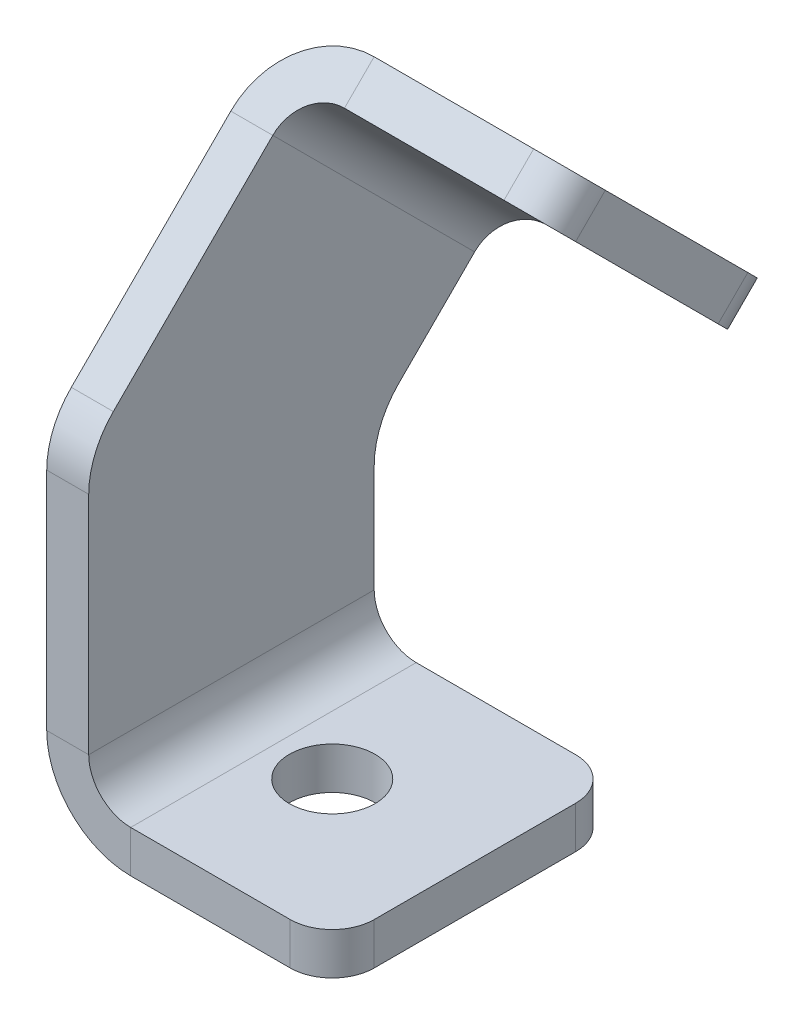
ISO-10303-21;
HEADER;
FILE_DESCRIPTION(('STEP AP214'),'2;1');
FILE_NAME('part.step','',(''),(''),'','','');
FILE_SCHEMA(('AUTOMOTIVE_DESIGN { 1 0 10303 214 1 1 1 1 }'));
ENDSEC;
DATA;
#1=APPLICATION_CONTEXT('core data for automotive mechanical design processes');
#2=APPLICATION_PROTOCOL_DEFINITION('international standard','automotive_design',2000,#1);
#3=PRODUCT_CONTEXT('',#1,'mechanical');
#4=PRODUCT('Part','Part','',(#3));
#5=PRODUCT_RELATED_PRODUCT_CATEGORY('part','',(#4));
#6=PRODUCT_DEFINITION_FORMATION('','',#4);
#7=PRODUCT_DEFINITION_CONTEXT('part definition',#1,'design');
#8=PRODUCT_DEFINITION('design','',#6,#7);
#9=PRODUCT_DEFINITION_SHAPE('','',#8);
#10=(LENGTH_UNIT() NAMED_UNIT(*) SI_UNIT(.MILLI.,.METRE.));
#11=(NAMED_UNIT(*) PLANE_ANGLE_UNIT() SI_UNIT($,.RADIAN.));
#12=(NAMED_UNIT(*) SI_UNIT($,.STERADIAN.) SOLID_ANGLE_UNIT());
#13=UNCERTAINTY_MEASURE_WITH_UNIT(LENGTH_MEASURE(1.E-05),#10,'distance_accuracy_value','');
#14=(GEOMETRIC_REPRESENTATION_CONTEXT(3) GLOBAL_UNCERTAINTY_ASSIGNED_CONTEXT((#13)) GLOBAL_UNIT_ASSIGNED_CONTEXT((#10,
#11,#12)) REPRESENTATION_CONTEXT('',''));
#15=CARTESIAN_POINT('',(0.,0.,0.));
#16=DIRECTION('',(0.,0.,1.));
#17=DIRECTION('',(1.,0.,0.));
#18=AXIS2_PLACEMENT_3D('',#15,#16,#17);
#19=CARTESIAN_POINT('',(2.5,18.4289321881345,12.));
#20=DIRECTION('',(1.,0.,0.));
#21=DIRECTION('',(0.,0.,-1.));
#22=AXIS2_PLACEMENT_3D('',#19,#20,#21);
#23=CYLINDRICAL_SURFACE('',#22,5.);
#24=DIRECTION('',(1.,0.,0.));
#25=VECTOR('',#24,1.);
#26=CARTESIAN_POINT('',(2.5,21.9644660940673,15.5355339059327));
#27=LINE('',#26,#25);
#28=CARTESIAN_POINT('',(0.,21.9644660940673,15.5355339059327));
#29=VERTEX_POINT('',#28);
#30=CARTESIAN_POINT('',(2.5,21.9644660940673,15.5355339059327));
#31=VERTEX_POINT('',#30);
#32=EDGE_CURVE('E10',#29,#31,#27,.T.);
#33=ORIENTED_EDGE('',*,*,#32,.F.);
#34=CARTESIAN_POINT('',(0.,18.4289321881345,12.));
#35=DIRECTION('',(1.,0.,0.));
#36=DIRECTION('',(0.,0.,-1.));
#37=AXIS2_PLACEMENT_3D('',#34,#35,#36);
#38=CIRCLE('',#37,5.);
#39=CARTESIAN_POINT('',(0.,18.4289321881345,17.));
#40=VERTEX_POINT('',#39);
#41=EDGE_CURVE('E136',#29,#40,#38,.T.);
#42=ORIENTED_EDGE('',*,*,#41,.T.);
#43=DIRECTION('',(1.,0.,0.));
#44=VECTOR('',#43,1.);
#45=CARTESIAN_POINT('',(2.5,18.4289321881345,17.));
#46=LINE('',#45,#44);
#47=CARTESIAN_POINT('',(2.5,18.4289321881345,17.));
#48=VERTEX_POINT('',#47);
#49=EDGE_CURVE('E26',#40,#48,#46,.T.);
#50=ORIENTED_EDGE('',*,*,#49,.T.);
#51=CARTESIAN_POINT('',(2.5,18.4289321881345,12.));
#52=DIRECTION('',(1.,0.,0.));
#53=DIRECTION('',(0.,0.,-1.));
#54=AXIS2_PLACEMENT_3D('',#51,#52,#53);
#55=CIRCLE('',#54,5.);
#56=EDGE_CURVE('E254',#31,#48,#55,.T.);
#57=ORIENTED_EDGE('',*,*,#56,.F.);
#58=EDGE_LOOP('',(#33,#42,#50,#57));
#59=FACE_BOUND('',#58,.T.);
#60=ADVANCED_FACE('F16',(#59),#23,.T.);
#61=CARTESIAN_POINT('',(2.5,0.,17.));
#62=DIRECTION('',(0.,0.,-1.));
#63=DIRECTION('',(0.,1.,0.));
#64=AXIS2_PLACEMENT_3D('',#61,#62,#63);
#65=PLANE('',#64);
#66=ORIENTED_EDGE('',*,*,#49,.F.);
#67=DIRECTION('',(0.,1.,0.));
#68=VECTOR('',#67,1.);
#69=CARTESIAN_POINT('',(0.,0.,17.));
#70=LINE('',#69,#68);
#71=CARTESIAN_POINT('',(0.,5.,17.));
#72=VERTEX_POINT('',#71);
#73=EDGE_CURVE('E195',#40,#72,#70,.F.);
#74=ORIENTED_EDGE('',*,*,#73,.T.);
#75=DIRECTION('',(1.,0.,0.));
#76=VECTOR('',#75,1.);
#77=CARTESIAN_POINT('',(2.5,5.,17.));
#78=LINE('',#77,#76);
#79=CARTESIAN_POINT('',(2.5,5.,17.));
#80=VERTEX_POINT('',#79);
#81=EDGE_CURVE('E247',#72,#80,#78,.T.);
#82=ORIENTED_EDGE('',*,*,#81,.T.);
#83=DIRECTION('',(0.,1.,0.));
#84=VECTOR('',#83,1.);
#85=CARTESIAN_POINT('',(2.5,0.,17.));
#86=LINE('',#85,#84);
#87=EDGE_CURVE('E264',#48,#80,#86,.F.);
#88=ORIENTED_EDGE('',*,*,#87,.F.);
#89=EDGE_LOOP('',(#66,#74,#82,#88));
#90=FACE_BOUND('',#89,.T.);
#91=ADVANCED_FACE('F267',(#90),#65,.F.);
#92=CARTESIAN_POINT('',(5.,5.,17.));
#93=DIRECTION('',(0.,0.,1.));
#94=DIRECTION('',(1.,0.,0.));
#95=AXIS2_PLACEMENT_3D('',#92,#93,#94);
#96=PLANE('',#95);
#97=ORIENTED_EDGE('',*,*,#81,.F.);
#98=CARTESIAN_POINT('',(5.,5.,17.));
#99=DIRECTION('',(0.,0.,1.));
#100=DIRECTION('',(1.,0.,0.));
#101=AXIS2_PLACEMENT_3D('',#98,#99,#100);
#102=CIRCLE('',#101,5.);
#103=CARTESIAN_POINT('',(5.,0.,17.));
#104=VERTEX_POINT('',#103);
#105=EDGE_CURVE('E170',#104,#72,#102,.F.);
#106=ORIENTED_EDGE('',*,*,#105,.F.);
#107=DIRECTION('',(0.,1.,0.));
#108=VECTOR('',#107,1.);
#109=CARTESIAN_POINT('',(5.,2.5,17.));
#110=LINE('',#109,#108);
#111=CARTESIAN_POINT('',(5.,2.5,17.));
#112=VERTEX_POINT('',#111);
#113=EDGE_CURVE('E244',#104,#112,#110,.T.);
#114=ORIENTED_EDGE('',*,*,#113,.T.);
#115=CARTESIAN_POINT('',(5.,5.,17.));
#116=DIRECTION('',(0.,0.,-1.));
#117=DIRECTION('',(-1.,0.,0.));
#118=AXIS2_PLACEMENT_3D('',#115,#116,#117);
#119=CIRCLE('',#118,2.5);
#120=EDGE_CURVE('E279',#112,#80,#119,.T.);
#121=ORIENTED_EDGE('',*,*,#120,.T.);
#122=EDGE_LOOP('',(#97,#106,#114,#121));
#123=FACE_BOUND('',#122,.T.);
#124=ADVANCED_FACE('F336',(#123),#96,.T.);
#125=CARTESIAN_POINT('',(0.,2.5,17.));
#126=DIRECTION('',(0.,0.,1.));
#127=DIRECTION('',(1.,0.,0.));
#128=AXIS2_PLACEMENT_3D('',#125,#126,#127);
#129=PLANE('',#128);
#130=ORIENTED_EDGE('',*,*,#113,.F.);
#131=DIRECTION('',(1.,0.,0.));
#132=VECTOR('',#131,1.);
#133=CARTESIAN_POINT('',(0.,0.,17.));
#134=LINE('',#133,#132);
#135=CARTESIAN_POINT('',(14.5,0.,17.));
#136=VERTEX_POINT('',#135);
#137=EDGE_CURVE('E190',#104,#136,#134,.T.);
#138=ORIENTED_EDGE('',*,*,#137,.T.);
#139=DIRECTION('',(0.,1.,0.));
#140=VECTOR('',#139,1.);
#141=CARTESIAN_POINT('',(14.5,2.5,17.));
#142=LINE('',#141,#140);
#143=CARTESIAN_POINT('',(14.5,2.5,17.));
#144=VERTEX_POINT('',#143);
#145=EDGE_CURVE('E241',#136,#144,#142,.T.);
#146=ORIENTED_EDGE('',*,*,#145,.T.);
#147=DIRECTION('',(1.,0.,0.));
#148=VECTOR('',#147,1.);
#149=CARTESIAN_POINT('',(0.,2.5,17.));
#150=LINE('',#149,#148);
#151=EDGE_CURVE('E388',#112,#144,#150,.T.);
#152=ORIENTED_EDGE('',*,*,#151,.F.);
#153=EDGE_LOOP('',(#130,#138,#146,#152));
#154=FACE_BOUND('',#153,.T.);
#155=ADVANCED_FACE('F658',(#154),#129,.T.);
#156=CARTESIAN_POINT('',(14.5,2.5,14.5));
#157=DIRECTION('',(0.,1.,0.));
#158=DIRECTION('',(0.,0.,1.));
#159=AXIS2_PLACEMENT_3D('',#156,#157,#158);
#160=CYLINDRICAL_SURFACE('',#159,2.5);
#161=ORIENTED_EDGE('',*,*,#145,.F.);
#162=CARTESIAN_POINT('',(14.5,0.,14.5));
#163=DIRECTION('',(0.,1.,0.));
#164=DIRECTION('',(0.,0.,1.));
#165=AXIS2_PLACEMENT_3D('',#162,#163,#164);
#166=CIRCLE('',#165,2.5);
#167=CARTESIAN_POINT('',(17.,0.,14.5));
#168=VERTEX_POINT('',#167);
#169=EDGE_CURVE('E166',#136,#168,#166,.T.);
#170=ORIENTED_EDGE('',*,*,#169,.T.);
#171=DIRECTION('',(0.,1.,0.));
#172=VECTOR('',#171,1.);
#173=CARTESIAN_POINT('',(17.,2.5,14.5));
#174=LINE('',#173,#172);
#175=CARTESIAN_POINT('',(17.,2.5,14.5));
#176=VERTEX_POINT('',#175);
#177=EDGE_CURVE('E238',#168,#176,#174,.T.);
#178=ORIENTED_EDGE('',*,*,#177,.T.);
#179=CARTESIAN_POINT('',(14.5,2.5,14.5));
#180=DIRECTION('',(0.,1.,0.));
#181=DIRECTION('',(0.,0.,1.));
#182=AXIS2_PLACEMENT_3D('',#179,#180,#181);
#183=CIRCLE('',#182,2.5);
#184=EDGE_CURVE('E384',#144,#176,#183,.T.);
#185=ORIENTED_EDGE('',*,*,#184,.F.);
#186=EDGE_LOOP('',(#161,#170,#178,#185));
#187=FACE_BOUND('',#186,.T.);
#188=ADVANCED_FACE('F649',(#187),#160,.T.);
#189=CARTESIAN_POINT('',(17.,2.5,17.));
#190=DIRECTION('',(1.,0.,0.));
#191=DIRECTION('',(0.,0.,-1.));
#192=AXIS2_PLACEMENT_3D('',#189,#190,#191);
#193=PLANE('',#192);
#194=ORIENTED_EDGE('',*,*,#177,.F.);
#195=DIRECTION('',(0.,0.,1.));
#196=VECTOR('',#195,1.);
#197=CARTESIAN_POINT('',(17.,0.,17.));
#198=LINE('',#197,#196);
#199=CARTESIAN_POINT('',(17.,0.,2.5));
#200=VERTEX_POINT('',#199);
#201=EDGE_CURVE('E184',#168,#200,#198,.F.);
#202=ORIENTED_EDGE('',*,*,#201,.T.);
#203=DIRECTION('',(0.,1.,0.));
#204=VECTOR('',#203,1.);
#205=CARTESIAN_POINT('',(17.,2.5,2.5));
#206=LINE('',#205,#204);
#207=CARTESIAN_POINT('',(17.,2.5,2.5));
#208=VERTEX_POINT('',#207);
#209=EDGE_CURVE('E235',#200,#208,#206,.T.);
#210=ORIENTED_EDGE('',*,*,#209,.T.);
#211=DIRECTION('',(0.,0.,-1.));
#212=VECTOR('',#211,1.);
#213=CARTESIAN_POINT('',(17.,2.5,17.));
#214=LINE('',#213,#212);
#215=EDGE_CURVE('E401',#176,#208,#214,.T.);
#216=ORIENTED_EDGE('',*,*,#215,.F.);
#217=EDGE_LOOP('',(#194,#202,#210,#216));
#218=FACE_BOUND('',#217,.T.);
#219=ADVANCED_FACE('F640',(#218),#193,.T.);
#220=CARTESIAN_POINT('',(14.5,2.5,2.5));
#221=DIRECTION('',(0.,1.,0.));
#222=DIRECTION('',(0.,0.,1.));
#223=AXIS2_PLACEMENT_3D('',#220,#221,#222);
#224=CYLINDRICAL_SURFACE('',#223,2.5);
#225=ORIENTED_EDGE('',*,*,#209,.F.);
#226=CARTESIAN_POINT('',(14.5,0.,2.5));
#227=DIRECTION('',(0.,1.,0.));
#228=DIRECTION('',(0.,0.,1.));
#229=AXIS2_PLACEMENT_3D('',#226,#227,#228);
#230=CIRCLE('',#229,2.5);
#231=CARTESIAN_POINT('',(14.5,0.,0.));
#232=VERTEX_POINT('',#231);
#233=EDGE_CURVE('E181',#200,#232,#230,.T.);
#234=ORIENTED_EDGE('',*,*,#233,.T.);
#235=DIRECTION('',(0.,1.,0.));
#236=VECTOR('',#235,1.);
#237=CARTESIAN_POINT('',(14.5,2.5,0.));
#238=LINE('',#237,#236);
#239=CARTESIAN_POINT('',(14.5,2.5,0.));
#240=VERTEX_POINT('',#239);
#241=EDGE_CURVE('E232',#232,#240,#238,.T.);
#242=ORIENTED_EDGE('',*,*,#241,.T.);
#243=CARTESIAN_POINT('',(14.5,2.5,2.5));
#244=DIRECTION('',(0.,1.,0.));
#245=DIRECTION('',(0.,0.,1.));
#246=AXIS2_PLACEMENT_3D('',#243,#244,#245);
#247=CIRCLE('',#246,2.5);
#248=EDGE_CURVE('E398',#208,#240,#247,.T.);
#249=ORIENTED_EDGE('',*,*,#248,.F.);
#250=EDGE_LOOP('',(#225,#234,#242,#249));
#251=FACE_BOUND('',#250,.T.);
#252=ADVANCED_FACE('F632',(#251),#224,.T.);
#253=CARTESIAN_POINT('',(0.,2.5,0.));
#254=DIRECTION('',(0.,0.,1.));
#255=DIRECTION('',(1.,0.,0.));
#256=AXIS2_PLACEMENT_3D('',#253,#254,#255);
#257=PLANE('',#256);
#258=ORIENTED_EDGE('',*,*,#241,.F.);
#259=DIRECTION('',(1.,0.,0.));
#260=VECTOR('',#259,1.);
#261=CARTESIAN_POINT('',(0.,0.,0.));
#262=LINE('',#261,#260);
#263=CARTESIAN_POINT('',(5.,0.,0.));
#264=VERTEX_POINT('',#263);
#265=EDGE_CURVE('E178',#264,#232,#262,.T.);
#266=ORIENTED_EDGE('',*,*,#265,.F.);
#267=DIRECTION('',(0.,1.,0.));
#268=VECTOR('',#267,1.);
#269=CARTESIAN_POINT('',(5.,2.5,0.));
#270=LINE('',#269,#268);
#271=CARTESIAN_POINT('',(5.,2.5,0.));
#272=VERTEX_POINT('',#271);
#273=EDGE_CURVE('E229',#264,#272,#270,.T.);
#274=ORIENTED_EDGE('',*,*,#273,.T.);
#275=DIRECTION('',(1.,0.,0.));
#276=VECTOR('',#275,1.);
#277=CARTESIAN_POINT('',(0.,2.5,0.));
#278=LINE('',#277,#276);
#279=EDGE_CURVE('E396',#272,#240,#278,.T.);
#280=ORIENTED_EDGE('',*,*,#279,.T.);
#281=EDGE_LOOP('',(#258,#266,#274,#280));
#282=FACE_BOUND('',#281,.T.);
#283=ADVANCED_FACE('F624',(#282),#257,.F.);
#284=CARTESIAN_POINT('',(5.,5.,0.));
#285=DIRECTION('',(0.,0.,1.));
#286=DIRECTION('',(1.,0.,0.));
#287=AXIS2_PLACEMENT_3D('',#284,#285,#286);
#288=PLANE('',#287);
#289=ORIENTED_EDGE('',*,*,#273,.F.);
#290=CARTESIAN_POINT('',(5.,5.,0.));
#291=DIRECTION('',(0.,0.,1.));
#292=DIRECTION('',(1.,0.,0.));
#293=AXIS2_PLACEMENT_3D('',#290,#291,#292);
#294=CIRCLE('',#293,5.);
#295=CARTESIAN_POINT('',(0.,5.,0.));
#296=VERTEX_POINT('',#295);
#297=EDGE_CURVE('E175',#296,#264,#294,.T.);
#298=ORIENTED_EDGE('',*,*,#297,.F.);
#299=DIRECTION('',(1.,0.,0.));
#300=VECTOR('',#299,1.);
#301=CARTESIAN_POINT('',(2.5,5.,0.));
#302=LINE('',#301,#300);
#303=CARTESIAN_POINT('',(2.5,5.,0.));
#304=VERTEX_POINT('',#303);
#305=EDGE_CURVE('E226',#296,#304,#302,.T.);
#306=ORIENTED_EDGE('',*,*,#305,.T.);
#307=CARTESIAN_POINT('',(5.,5.,0.));
#308=DIRECTION('',(0.,0.,-1.));
#309=DIRECTION('',(-1.,0.,0.));
#310=AXIS2_PLACEMENT_3D('',#307,#308,#309);
#311=CIRCLE('',#310,2.5);
#312=EDGE_CURVE('E281',#304,#272,#311,.F.);
#313=ORIENTED_EDGE('',*,*,#312,.T.);
#314=EDGE_LOOP('',(#289,#298,#306,#313));
#315=FACE_BOUND('',#314,.T.);
#316=ADVANCED_FACE('F319',(#315),#288,.F.);
#317=CARTESIAN_POINT('',(2.5,0.,0.));
#318=DIRECTION('',(0.,0.,-1.));
#319=DIRECTION('',(0.,1.,0.));
#320=AXIS2_PLACEMENT_3D('',#317,#318,#319);
#321=PLANE('',#320);
#322=ORIENTED_EDGE('',*,*,#305,.F.);
#323=DIRECTION('',(0.,1.,0.));
#324=VECTOR('',#323,1.);
#325=CARTESIAN_POINT('',(0.,0.,0.));
#326=LINE('',#325,#324);
#327=CARTESIAN_POINT('',(0.,11.3873016277919,0.));
#328=VERTEX_POINT('',#327);
#329=EDGE_CURVE('E171',#328,#296,#326,.F.);
#330=ORIENTED_EDGE('',*,*,#329,.F.);
#331=DIRECTION('',(1.,0.,0.));
#332=VECTOR('',#331,1.);
#333=CARTESIAN_POINT('',(2.5,11.3873016277919,0.));
#334=LINE('',#333,#332);
#335=CARTESIAN_POINT('',(2.5,11.3873016277919,0.));
#336=VERTEX_POINT('',#335);
#337=EDGE_CURVE('E223',#328,#336,#334,.T.);
#338=ORIENTED_EDGE('',*,*,#337,.T.);
#339=DIRECTION('',(0.,1.,0.));
#340=VECTOR('',#339,1.);
#341=CARTESIAN_POINT('',(2.5,0.,0.));
#342=LINE('',#341,#340);
#343=EDGE_CURVE('E270',#336,#304,#342,.F.);
#344=ORIENTED_EDGE('',*,*,#343,.T.);
#345=EDGE_LOOP('',(#322,#330,#338,#344));
#346=FACE_BOUND('',#345,.T.);
#347=ADVANCED_FACE('F608',(#346),#321,.T.);
#348=CARTESIAN_POINT('',(2.5,11.3873016277919,-5.));
#349=DIRECTION('',(1.,0.,0.));
#350=DIRECTION('',(0.,0.,-1.));
#351=AXIS2_PLACEMENT_3D('',#348,#349,#350);
#352=CYLINDRICAL_SURFACE('',#351,5.);
#353=ORIENTED_EDGE('',*,*,#337,.F.);
#354=CARTESIAN_POINT('',(0.,11.3873016277919,-5.));
#355=DIRECTION('',(1.,0.,0.));
#356=DIRECTION('',(0.,0.,-1.));
#357=AXIS2_PLACEMENT_3D('',#354,#355,#356);
#358=CIRCLE('',#357,5.);
#359=CARTESIAN_POINT('',(0.,14.9228355337246,-1.46446609406727));
#360=VERTEX_POINT('',#359);
#361=EDGE_CURVE('E167',#328,#360,#358,.F.);
#362=ORIENTED_EDGE('',*,*,#361,.T.);
#363=DIRECTION('',(1.,0.,0.));
#364=VECTOR('',#363,1.);
#365=CARTESIAN_POINT('',(2.5,14.9228355337246,-1.46446609406727));
#366=LINE('',#365,#364);
#367=CARTESIAN_POINT('',(2.5,14.9228355337246,-1.46446609406727));
#368=VERTEX_POINT('',#367);
#369=EDGE_CURVE('E220',#360,#368,#366,.T.);
#370=ORIENTED_EDGE('',*,*,#369,.T.);
#371=CARTESIAN_POINT('',(2.5,11.3873016277919,-5.));
#372=DIRECTION('',(1.,0.,0.));
#373=DIRECTION('',(0.,0.,-1.));
#374=AXIS2_PLACEMENT_3D('',#371,#372,#373);
#375=CIRCLE('',#374,5.);
#376=EDGE_CURVE('E276',#336,#368,#375,.F.);
#377=ORIENTED_EDGE('',*,*,#376,.F.);
#378=EDGE_LOOP('',(#353,#362,#370,#377));
#379=FACE_BOUND('',#378,.T.);
#380=ADVANCED_FACE('F600',(#379),#352,.F.);
#381=CARTESIAN_POINT('',(2.5,22.9748737341529,-9.51650429449554));
#382=DIRECTION('',(0.,0.707106781186549,0.707106781186546));
#383=DIRECTION('',(0.,-0.707106781186546,0.707106781186549));
#384=AXIS2_PLACEMENT_3D('',#381,#382,#383);
#385=PLANE('',#384);
#386=ORIENTED_EDGE('',*,*,#369,.F.);
#387=DIRECTION('',(0.,-0.707106781186546,0.707106781186549));
#388=VECTOR('',#387,1.);
#389=CARTESIAN_POINT('',(0.,22.9748737341529,-9.51650429449554));
#390=LINE('',#389,#388);
#391=CARTESIAN_POINT('',(0.,19.4393398282201,-5.9809703885628));
#392=VERTEX_POINT('',#391);
#393=EDGE_CURVE('E132',#360,#392,#390,.F.);
#394=ORIENTED_EDGE('',*,*,#393,.T.);
#395=DIRECTION('',(1.,0.,0.));
#396=VECTOR('',#395,1.);
#397=CARTESIAN_POINT('',(2.5,19.4393398282201,-5.98097038856279));
#398=LINE('',#397,#396);
#399=CARTESIAN_POINT('',(2.5,19.4393398282201,-5.98097038856279));
#400=VERTEX_POINT('',#399);
#401=EDGE_CURVE('E217',#392,#400,#398,.T.);
#402=ORIENTED_EDGE('',*,*,#401,.T.);
#403=DIRECTION('',(0.,-0.707106781186546,0.707106781186549));
#404=VECTOR('',#403,1.);
#405=CARTESIAN_POINT('',(2.5,22.9748737341529,-9.51650429449554));
#406=LINE('',#405,#404);
#407=EDGE_CURVE('E380',#368,#400,#406,.F.);
#408=ORIENTED_EDGE('',*,*,#407,.F.);
#409=EDGE_LOOP('',(#386,#394,#402,#408));
#410=FACE_BOUND('',#409,.T.);
#411=ADVANCED_FACE('F379',(#410),#385,.F.);
#412=CARTESIAN_POINT('',(5.,19.4393398282201,-5.98097038856279));
#413=DIRECTION('',(0.,0.707106781186549,0.707106781186546));
#414=DIRECTION('',(0.,-0.707106781186546,0.707106781186549));
#415=AXIS2_PLACEMENT_3D('',#412,#413,#414);
#416=PLANE('',#415);
#417=ORIENTED_EDGE('',*,*,#401,.F.);
#418=CARTESIAN_POINT('',(5.,19.4393398282201,-5.9809703885628));
#419=DIRECTION('',(0.,0.707106781186549,0.707106781186546));
#420=DIRECTION('',(0.,-0.707106781186546,0.707106781186549));
#421=AXIS2_PLACEMENT_3D('',#418,#419,#420);
#422=CIRCLE('',#421,5.);
#423=CARTESIAN_POINT('',(5.,22.9748737341529,-9.51650429449554));
#424=VERTEX_POINT('',#423);
#425=EDGE_CURVE('E128',#424,#392,#422,.T.);
#426=ORIENTED_EDGE('',*,*,#425,.F.);
#427=DIRECTION('',(0.,-0.707106781186546,0.707106781186549));
#428=VECTOR('',#427,1.);
#429=CARTESIAN_POINT('',(5.,21.2071067811865,-7.74873734152917));
#430=LINE('',#429,#428);
#431=CARTESIAN_POINT('',(5.,21.2071067811865,-7.74873734152917));
#432=VERTEX_POINT('',#431);
#433=EDGE_CURVE('E34',#424,#432,#430,.T.);
#434=ORIENTED_EDGE('',*,*,#433,.T.);
#435=CARTESIAN_POINT('',(5.,19.4393398282201,-5.98097038856279));
#436=DIRECTION('',(0.,-0.707106781186549,-0.707106781186546));
#437=DIRECTION('',(0.,0.707106781186546,-0.707106781186549));
#438=AXIS2_PLACEMENT_3D('',#435,#436,#437);
#439=CIRCLE('',#438,2.5);
#440=EDGE_CURVE('E118',#432,#400,#439,.F.);
#441=ORIENTED_EDGE('',*,*,#440,.T.);
#442=EDGE_LOOP('',(#417,#426,#434,#441));
#443=FACE_BOUND('',#442,.T.);
#444=ADVANCED_FACE('F373',(#443),#416,.F.);
#445=CARTESIAN_POINT('',(0.,21.2071067811865,-7.74873734152917));
#446=DIRECTION('',(0.,-0.707106781186549,-0.707106781186546));
#447=DIRECTION('',(1.,0.,0.));
#448=AXIS2_PLACEMENT_3D('',#445,#446,#447);
#449=PLANE('',#448);
#450=ORIENTED_EDGE('',*,*,#433,.F.);
#451=DIRECTION('',(-1.,0.,0.));
#452=VECTOR('',#451,1.);
#453=CARTESIAN_POINT('',(0.,22.9748737341529,-9.51650429449554));
#454=LINE('',#453,#452);
#455=CARTESIAN_POINT('',(14.5,22.9748737341529,-9.51650429449554));
#456=VERTEX_POINT('',#455);
#457=EDGE_CURVE('E161',#424,#456,#454,.F.);
#458=ORIENTED_EDGE('',*,*,#457,.T.);
#459=DIRECTION('',(0.,-0.707106781186546,0.707106781186549));
#460=VECTOR('',#459,1.);
#461=CARTESIAN_POINT('',(14.5,21.2071067811865,-7.74873734152917));
#462=LINE('',#461,#460);
#463=CARTESIAN_POINT('',(14.5,21.2071067811865,-7.74873734152917));
#464=VERTEX_POINT('',#463);
#465=EDGE_CURVE('E213',#456,#464,#462,.T.);
#466=ORIENTED_EDGE('',*,*,#465,.T.);
#467=DIRECTION('',(1.,0.,0.));
#468=VECTOR('',#467,1.);
#469=CARTESIAN_POINT('',(0.,21.2071067811865,-7.74873734152917));
#470=LINE('',#469,#468);
#471=EDGE_CURVE('E287',#432,#464,#470,.T.);
#472=ORIENTED_EDGE('',*,*,#471,.F.);
#473=EDGE_LOOP('',(#450,#458,#466,#472));
#474=FACE_BOUND('',#473,.T.);
#475=ADVANCED_FACE('F577',(#474),#449,.T.);
#476=CARTESIAN_POINT('',(14.5,22.9748737341529,-5.9809703885628));
#477=DIRECTION('',(0.,-0.707106781186546,0.707106781186549));
#478=DIRECTION('',(0.,-0.707106781186549,-0.707106781186546));
#479=AXIS2_PLACEMENT_3D('',#476,#477,#478);
#480=CYLINDRICAL_SURFACE('',#479,2.5);
#481=ORIENTED_EDGE('',*,*,#465,.F.);
#482=CARTESIAN_POINT('',(14.5,24.7426406871193,-7.74873734152917));
#483=DIRECTION('',(0.,-0.707106781186546,0.707106781186549));
#484=DIRECTION('',(0.,-0.707106781186549,-0.707106781186546));
#485=AXIS2_PLACEMENT_3D('',#482,#483,#484);
#486=CIRCLE('',#485,2.5);
#487=CARTESIAN_POINT('',(17.,24.7426406871193,-7.74873734152917));
#488=VERTEX_POINT('',#487);
#489=EDGE_CURVE('E158',#456,#488,#486,.T.);
#490=ORIENTED_EDGE('',*,*,#489,.T.);
#491=DIRECTION('',(0.,-0.707106781186546,0.707106781186549));
#492=VECTOR('',#491,1.);
#493=CARTESIAN_POINT('',(17.,22.9748737341529,-5.9809703885628));
#494=LINE('',#493,#492);
#495=CARTESIAN_POINT('',(17.,22.9748737341529,-5.9809703885628));
#496=VERTEX_POINT('',#495);
#497=EDGE_CURVE('E210',#488,#496,#494,.T.);
#498=ORIENTED_EDGE('',*,*,#497,.T.);
#499=CARTESIAN_POINT('',(14.5,22.9748737341529,-5.9809703885628));
#500=DIRECTION('',(0.,-0.707106781186546,0.707106781186549));
#501=DIRECTION('',(0.,-0.707106781186549,-0.707106781186546));
#502=AXIS2_PLACEMENT_3D('',#499,#500,#501);
#503=CIRCLE('',#502,2.5);
#504=EDGE_CURVE('E290',#464,#496,#503,.T.);
#505=ORIENTED_EDGE('',*,*,#504,.F.);
#506=EDGE_LOOP('',(#481,#490,#498,#505));
#507=FACE_BOUND('',#506,.T.);
#508=ADVANCED_FACE('F568',(#507),#480,.T.);
#509=CARTESIAN_POINT('',(17.,33.2279220613578,4.27207793864212));
#510=DIRECTION('',(-1.,0.,0.));
#511=DIRECTION('',(0.,-0.707106781186549,-0.707106781186546));
#512=AXIS2_PLACEMENT_3D('',#509,#510,#511);
#513=PLANE('',#512);
#514=ORIENTED_EDGE('',*,*,#497,.F.);
#515=DIRECTION('',(0.,0.707106781186549,0.707106781186546));
#516=VECTOR('',#515,1.);
#517=CARTESIAN_POINT('',(17.,34.9956890143242,2.50431098567575));
#518=LINE('',#517,#516);
#519=CARTESIAN_POINT('',(17.,33.2279220613578,0.73654403270938));
#520=VERTEX_POINT('',#519);
#521=EDGE_CURVE('E155',#520,#488,#518,.F.);
#522=ORIENTED_EDGE('',*,*,#521,.F.);
#523=DIRECTION('',(0.,-0.707106781186546,0.707106781186549));
#524=VECTOR('',#523,1.);
#525=CARTESIAN_POINT('',(17.,31.4601551083915,2.50431098567575));
#526=LINE('',#525,#524);
#527=CARTESIAN_POINT('',(17.,31.4601551083915,2.50431098567575));
#528=VERTEX_POINT('',#527);
#529=EDGE_CURVE('E207',#520,#528,#526,.T.);
#530=ORIENTED_EDGE('',*,*,#529,.T.);
#531=DIRECTION('',(0.,-0.707106781186549,-0.707106781186546));
#532=VECTOR('',#531,1.);
#533=CARTESIAN_POINT('',(17.,33.2279220613578,4.27207793864212));
#534=LINE('',#533,#532);
#535=EDGE_CURVE('E293',#528,#496,#534,.T.);
#536=ORIENTED_EDGE('',*,*,#535,.T.);
#537=EDGE_LOOP('',(#514,#522,#530,#536));
#538=FACE_BOUND('',#537,.T.);
#539=ADVANCED_FACE('F560',(#538),#513,.F.);
#540=CARTESIAN_POINT('',(14.5,31.4601551083915,2.50431098567576));
#541=DIRECTION('',(0.,-0.707106781186546,0.707106781186549));
#542=DIRECTION('',(0.,-0.707106781186549,-0.707106781186546));
#543=AXIS2_PLACEMENT_3D('',#540,#541,#542);
#544=CYLINDRICAL_SURFACE('',#543,2.5);
#545=ORIENTED_EDGE('',*,*,#529,.F.);
#546=CARTESIAN_POINT('',(14.5,33.2279220613578,0.736544032709381));
#547=DIRECTION('',(0.,-0.707106781186546,0.707106781186549));
#548=DIRECTION('',(0.,-0.707106781186549,-0.707106781186546));
#549=AXIS2_PLACEMENT_3D('',#546,#547,#548);
#550=CIRCLE('',#549,2.5);
#551=CARTESIAN_POINT('',(14.5,34.9956890143242,2.50431098567575));
#552=VERTEX_POINT('',#551);
#553=EDGE_CURVE('E152',#520,#552,#550,.T.);
#554=ORIENTED_EDGE('',*,*,#553,.T.);
#555=DIRECTION('',(0.,-0.707106781186546,0.707106781186549));
#556=VECTOR('',#555,1.);
#557=CARTESIAN_POINT('',(14.5,33.2279220613578,4.27207793864212));
#558=LINE('',#557,#556);
#559=CARTESIAN_POINT('',(14.5,33.2279220613578,4.27207793864212));
#560=VERTEX_POINT('',#559);
#561=EDGE_CURVE('E204',#552,#560,#558,.T.);
#562=ORIENTED_EDGE('',*,*,#561,.T.);
#563=CARTESIAN_POINT('',(14.5,31.4601551083915,2.50431098567576));
#564=DIRECTION('',(0.,-0.707106781186546,0.707106781186549));
#565=DIRECTION('',(0.,-0.707106781186549,-0.707106781186546));
#566=AXIS2_PLACEMENT_3D('',#563,#564,#565);
#567=CIRCLE('',#566,2.5);
#568=EDGE_CURVE('E296',#528,#560,#567,.T.);
#569=ORIENTED_EDGE('',*,*,#568,.F.);
#570=EDGE_LOOP('',(#545,#554,#562,#569));
#571=FACE_BOUND('',#570,.T.);
#572=ADVANCED_FACE('F359',(#571),#544,.T.);
#573=CARTESIAN_POINT('',(0.,33.2279220613578,4.27207793864212));
#574=DIRECTION('',(0.,-0.707106781186549,-0.707106781186546));
#575=DIRECTION('',(1.,0.,0.));
#576=AXIS2_PLACEMENT_3D('',#573,#574,#575);
#577=PLANE('',#576);
#578=ORIENTED_EDGE('',*,*,#561,.F.);
#579=DIRECTION('',(-1.,0.,0.));
#580=VECTOR('',#579,1.);
#581=CARTESIAN_POINT('',(0.,34.9956890143242,2.50431098567575));
#582=LINE('',#581,#580);
#583=CARTESIAN_POINT('',(5.,34.9956890143242,2.50431098567575));
#584=VERTEX_POINT('',#583);
#585=EDGE_CURVE('E144',#584,#552,#582,.F.);
#586=ORIENTED_EDGE('',*,*,#585,.F.);
#587=DIRECTION('',(0.,-0.707106781186546,0.707106781186549));
#588=VECTOR('',#587,1.);
#589=CARTESIAN_POINT('',(5.,33.2279220613578,4.27207793864212));
#590=LINE('',#589,#588);
#591=CARTESIAN_POINT('',(5.,33.2279220613578,4.27207793864212));
#592=VERTEX_POINT('',#591);
#593=EDGE_CURVE('E117',#584,#592,#590,.T.);
#594=ORIENTED_EDGE('',*,*,#593,.T.);
#595=DIRECTION('',(1.,0.,0.));
#596=VECTOR('',#595,1.);
#597=CARTESIAN_POINT('',(0.,33.2279220613578,4.27207793864212));
#598=LINE('',#597,#596);
#599=EDGE_CURVE('E299',#592,#560,#598,.T.);
#600=ORIENTED_EDGE('',*,*,#599,.T.);
#601=EDGE_LOOP('',(#578,#586,#594,#600));
#602=FACE_BOUND('',#601,.T.);
#603=ADVANCED_FACE('F366',(#602),#577,.F.);
#604=CARTESIAN_POINT('',(5.,31.4601551083915,6.03984489160849));
#605=DIRECTION('',(0.,0.707106781186549,0.707106781186546));
#606=DIRECTION('',(0.,-0.707106781186546,0.707106781186549));
#607=AXIS2_PLACEMENT_3D('',#604,#605,#606);
#608=PLANE('',#607);
#609=ORIENTED_EDGE('',*,*,#593,.F.);
#610=CARTESIAN_POINT('',(5.,31.4601551083915,6.03984489160849));
#611=DIRECTION('',(0.,0.707106781186549,0.707106781186546));
#612=DIRECTION('',(0.,-0.707106781186546,0.707106781186549));
#613=AXIS2_PLACEMENT_3D('',#610,#611,#612);
#614=CIRCLE('',#613,5.);
#615=CARTESIAN_POINT('',(0.,31.4601551083915,6.03984489160849));
#616=VERTEX_POINT('',#615);
#617=EDGE_CURVE('E126',#616,#584,#614,.F.);
#618=ORIENTED_EDGE('',*,*,#617,.F.);
#619=DIRECTION('',(1.,0.,0.));
#620=VECTOR('',#619,1.);
#621=CARTESIAN_POINT('',(2.5,31.4601551083915,6.03984489160849));
#622=LINE('',#621,#620);
#623=CARTESIAN_POINT('',(2.5,31.4601551083915,6.03984489160849));
#624=VERTEX_POINT('',#623);
#625=EDGE_CURVE('E20',#616,#624,#622,.T.);
#626=ORIENTED_EDGE('',*,*,#625,.T.);
#627=CARTESIAN_POINT('',(5.,31.4601551083915,6.03984489160849));
#628=DIRECTION('',(0.,-0.707106781186549,-0.707106781186546));
#629=DIRECTION('',(0.,0.707106781186546,-0.707106781186549));
#630=AXIS2_PLACEMENT_3D('',#627,#628,#629);
#631=CIRCLE('',#630,2.5);
#632=EDGE_CURVE('E305',#624,#592,#631,.T.);
#633=ORIENTED_EDGE('',*,*,#632,.T.);
#634=EDGE_LOOP('',(#609,#618,#626,#633));
#635=FACE_BOUND('',#634,.T.);
#636=ADVANCED_FACE('F138',(#635),#608,.T.);
#637=CARTESIAN_POINT('',(8.5,2.5,8.5));
#638=DIRECTION('',(0.,1.,0.));
#639=DIRECTION('',(0.,0.,1.));
#640=AXIS2_PLACEMENT_3D('',#637,#638,#639);
#641=CYLINDRICAL_SURFACE('',#640,2.55);
#642=CARTESIAN_POINT('',(8.5,2.5,8.5));
#643=DIRECTION('',(0.,1.,0.));
#644=DIRECTION('',(0.,0.,1.));
#645=AXIS2_PLACEMENT_3D('',#642,#643,#644);
#646=CIRCLE('',#645,2.55);
#647=CARTESIAN_POINT('',(8.5,2.5,11.05));
#648=VERTEX_POINT('',#647);
#649=EDGE_CURVE('E142',#648,#648,#646,.F.);
#650=ORIENTED_EDGE('',*,*,#649,.F.);
#651=EDGE_LOOP('',(#650));
#652=FACE_BOUND('',#651,.T.);
#653=CARTESIAN_POINT('',(8.5,0.,8.5));
#654=DIRECTION('',(0.,1.,0.));
#655=DIRECTION('',(0.,0.,1.));
#656=AXIS2_PLACEMENT_3D('',#653,#654,#655);
#657=CIRCLE('',#656,2.55);
#658=CARTESIAN_POINT('',(8.5,0.,11.05));
#659=VERTEX_POINT('',#658);
#660=EDGE_CURVE('E187',#659,#659,#657,.F.);
#661=ORIENTED_EDGE('',*,*,#660,.T.);
#662=EDGE_LOOP('',(#661));
#663=FACE_BOUND('',#662,.T.);
#664=ADVANCED_FACE('F18',(#652,#663),#641,.F.);
#665=CARTESIAN_POINT('',(8.5,27.2175144212722,-1.73832970144352));
#666=DIRECTION('',(0.,-0.707106781186546,0.707106781186549));
#667=DIRECTION('',(0.,-0.707106781186549,-0.707106781186546));
#668=AXIS2_PLACEMENT_3D('',#665,#666,#667);
#669=CYLINDRICAL_SURFACE('',#668,2.55);
#670=CARTESIAN_POINT('',(8.5,27.2175144212722,-1.73832970144352));
#671=DIRECTION('',(0.,0.707106781186546,-0.707106781186549));
#672=DIRECTION('',(0.,0.707106781186549,0.707106781186546));
#673=AXIS2_PLACEMENT_3D('',#670,#671,#672);
#674=CIRCLE('',#673,2.55);
#675=CARTESIAN_POINT('',(8.5,29.0206367132979,0.0647925905821701));
#676=VERTEX_POINT('',#675);
#677=EDGE_CURVE('E284',#676,#676,#674,.F.);
#678=ORIENTED_EDGE('',*,*,#677,.T.);
#679=EDGE_LOOP('',(#678));
#680=FACE_BOUND('',#679,.T.);
#681=CARTESIAN_POINT('',(8.5,28.9852813742385,-3.5060966544099));
#682=DIRECTION('',(0.,0.707106781186546,-0.707106781186549));
#683=DIRECTION('',(0.,0.707106781186549,0.707106781186546));
#684=AXIS2_PLACEMENT_3D('',#681,#682,#683);
#685=CIRCLE('',#684,2.55);
#686=CARTESIAN_POINT('',(8.5,30.7884036662642,-1.7029743623842));
#687=VERTEX_POINT('',#686);
#688=EDGE_CURVE('E163',#687,#687,#685,.F.);
#689=ORIENTED_EDGE('',*,*,#688,.F.);
#690=EDGE_LOOP('',(#689));
#691=FACE_BOUND('',#690,.T.);
#692=ADVANCED_FACE('F412',(#680,#691),#669,.F.);
#693=CARTESIAN_POINT('',(2.5,34.9956890143242,2.50431098567575));
#694=DIRECTION('',(0.,0.707106781186549,0.707106781186546));
#695=DIRECTION('',(0.,-0.707106781186546,0.707106781186549));
#696=AXIS2_PLACEMENT_3D('',#693,#694,#695);
#697=PLANE('',#696);
#698=DIRECTION('',(0.,-0.707106781186546,0.707106781186549));
#699=VECTOR('',#698,1.);
#700=CARTESIAN_POINT('',(0.,34.9956890143242,2.50431098567575));
#701=LINE('',#700,#699);
#702=EDGE_CURVE('E108',#29,#616,#701,.F.);
#703=ORIENTED_EDGE('',*,*,#702,.F.);
#704=ORIENTED_EDGE('',*,*,#32,.T.);
#705=DIRECTION('',(0.,-0.707106781186546,0.707106781186549));
#706=VECTOR('',#705,1.);
#707=CARTESIAN_POINT('',(2.5,34.9956890143242,2.50431098567575));
#708=LINE('',#707,#706);
#709=EDGE_CURVE('E111',#31,#624,#708,.F.);
#710=ORIENTED_EDGE('',*,*,#709,.T.);
#711=ORIENTED_EDGE('',*,*,#625,.F.);
#712=EDGE_LOOP('',(#703,#704,#710,#711));
#713=FACE_BOUND('',#712,.T.);
#714=ADVANCED_FACE('F106',(#713),#697,.T.);
#715=CARTESIAN_POINT('',(5.,31.4601551083915,6.03984489160849));
#716=DIRECTION('',(0.,0.707106781186549,0.707106781186546));
#717=DIRECTION('',(0.,-0.707106781186546,0.707106781186549));
#718=AXIS2_PLACEMENT_3D('',#715,#716,#717);
#719=CYLINDRICAL_SURFACE('',#718,2.5);
#720=ORIENTED_EDGE('',*,*,#632,.F.);
#721=DIRECTION('',(0.,-0.707106781186549,-0.707106781186546));
#722=VECTOR('',#721,1.);
#723=CARTESIAN_POINT('',(2.5,31.4601551083915,6.0398448916085));
#724=LINE('',#723,#722);
#725=EDGE_CURVE('E383',#400,#624,#724,.F.);
#726=ORIENTED_EDGE('',*,*,#725,.F.);
#727=ORIENTED_EDGE('',*,*,#440,.F.);
#728=DIRECTION('',(0.,-0.707106781186549,-0.707106781186546));
#729=VECTOR('',#728,1.);
#730=CARTESIAN_POINT('',(5.,21.2071067811865,-7.74873734152917));
#731=LINE('',#730,#729);
#732=EDGE_CURVE('E302',#592,#432,#731,.T.);
#733=ORIENTED_EDGE('',*,*,#732,.F.);
#734=EDGE_LOOP('',(#720,#726,#727,#733));
#735=FACE_BOUND('',#734,.T.);
#736=ADVANCED_FACE('F432',(#735),#719,.F.);
#737=CARTESIAN_POINT('',(0.,33.2279220613578,4.27207793864212));
#738=DIRECTION('',(0.,-0.707106781186546,0.707106781186549));
#739=DIRECTION('',(0.,0.707106781186549,0.707106781186546));
#740=AXIS2_PLACEMENT_3D('',#737,#738,#739);
#741=PLANE('',#740);
#742=ORIENTED_EDGE('',*,*,#677,.F.);
#743=EDGE_LOOP('',(#742));
#744=FACE_BOUND('',#743,.T.);
#745=ORIENTED_EDGE('',*,*,#471,.T.);
#746=ORIENTED_EDGE('',*,*,#504,.T.);
#747=ORIENTED_EDGE('',*,*,#535,.F.);
#748=ORIENTED_EDGE('',*,*,#568,.T.);
#749=ORIENTED_EDGE('',*,*,#599,.F.);
#750=ORIENTED_EDGE('',*,*,#732,.T.);
#751=EDGE_LOOP('',(#745,#746,#747,#748,#749,#750));
#752=FACE_BOUND('',#751,.T.);
#753=ADVANCED_FACE('F365',(#744,#752),#741,.T.);
#754=CARTESIAN_POINT('',(5.,5.,17.));
#755=DIRECTION('',(0.,0.,1.));
#756=DIRECTION('',(1.,0.,0.));
#757=AXIS2_PLACEMENT_3D('',#754,#755,#756);
#758=CYLINDRICAL_SURFACE('',#757,2.5);
#759=ORIENTED_EDGE('',*,*,#120,.F.);
#760=DIRECTION('',(0.,0.,-1.));
#761=VECTOR('',#760,1.);
#762=CARTESIAN_POINT('',(5.,2.5,17.));
#763=LINE('',#762,#761);
#764=EDGE_CURVE('E393',#272,#112,#763,.F.);
#765=ORIENTED_EDGE('',*,*,#764,.F.);
#766=ORIENTED_EDGE('',*,*,#312,.F.);
#767=DIRECTION('',(0.,0.,-1.));
#768=VECTOR('',#767,1.);
#769=CARTESIAN_POINT('',(2.5,5.,0.));
#770=LINE('',#769,#768);
#771=EDGE_CURVE('E268',#80,#304,#770,.T.);
#772=ORIENTED_EDGE('',*,*,#771,.F.);
#773=EDGE_LOOP('',(#759,#765,#766,#772));
#774=FACE_BOUND('',#773,.T.);
#775=ADVANCED_FACE('F343',(#774),#758,.F.);
#776=CARTESIAN_POINT('',(2.5,0.,17.));
#777=DIRECTION('',(1.,0.,0.));
#778=DIRECTION('',(0.,0.,-1.));
#779=AXIS2_PLACEMENT_3D('',#776,#777,#778);
#780=PLANE('',#779);
#781=ORIENTED_EDGE('',*,*,#407,.T.);
#782=ORIENTED_EDGE('',*,*,#725,.T.);
#783=ORIENTED_EDGE('',*,*,#709,.F.);
#784=ORIENTED_EDGE('',*,*,#56,.T.);
#785=ORIENTED_EDGE('',*,*,#87,.T.);
#786=ORIENTED_EDGE('',*,*,#771,.T.);
#787=ORIENTED_EDGE('',*,*,#343,.F.);
#788=ORIENTED_EDGE('',*,*,#376,.T.);
#789=EDGE_LOOP('',(#781,#782,#783,#784,#785,#786,#787,#788));
#790=FACE_BOUND('',#789,.T.);
#791=ADVANCED_FACE('F262',(#790),#780,.T.);
#792=CARTESIAN_POINT('',(0.,2.5,17.));
#793=DIRECTION('',(0.,1.,0.));
#794=DIRECTION('',(0.,0.,1.));
#795=AXIS2_PLACEMENT_3D('',#792,#793,#794);
#796=PLANE('',#795);
#797=ORIENTED_EDGE('',*,*,#649,.T.);
#798=EDGE_LOOP('',(#797));
#799=FACE_BOUND('',#798,.T.);
#800=ORIENTED_EDGE('',*,*,#215,.T.);
#801=ORIENTED_EDGE('',*,*,#248,.T.);
#802=ORIENTED_EDGE('',*,*,#279,.F.);
#803=ORIENTED_EDGE('',*,*,#764,.T.);
#804=ORIENTED_EDGE('',*,*,#151,.T.);
#805=ORIENTED_EDGE('',*,*,#184,.T.);
#806=EDGE_LOOP('',(#800,#801,#802,#803,#804,#805));
#807=FACE_BOUND('',#806,.T.);
#808=ADVANCED_FACE('F407',(#799,#807),#796,.T.);
#809=CARTESIAN_POINT('',(5.,31.4601551083915,6.03984489160849));
#810=DIRECTION('',(0.,0.707106781186549,0.707106781186546));
#811=DIRECTION('',(0.,-0.707106781186546,0.707106781186549));
#812=AXIS2_PLACEMENT_3D('',#809,#810,#811);
#813=CYLINDRICAL_SURFACE('',#812,5.);
#814=ORIENTED_EDGE('',*,*,#617,.T.);
#815=DIRECTION('',(0.,0.707106781186549,0.707106781186546));
#816=VECTOR('',#815,1.);
#817=CARTESIAN_POINT('',(5.,34.9956890143242,2.50431098567575));
#818=LINE('',#817,#816);
#819=EDGE_CURVE('E140',#584,#424,#818,.F.);
#820=ORIENTED_EDGE('',*,*,#819,.T.);
#821=ORIENTED_EDGE('',*,*,#425,.T.);
#822=DIRECTION('',(0.,0.707106781186549,0.707106781186546));
#823=VECTOR('',#822,1.);
#824=CARTESIAN_POINT('',(0.,31.4601551083915,6.03984489160849));
#825=LINE('',#824,#823);
#826=EDGE_CURVE('E123',#392,#616,#825,.T.);
#827=ORIENTED_EDGE('',*,*,#826,.T.);
#828=EDGE_LOOP('',(#814,#820,#821,#827));
#829=FACE_BOUND('',#828,.T.);
#830=ADVANCED_FACE('F124',(#829),#813,.T.);
#831=CARTESIAN_POINT('',(0.,34.9956890143242,2.50431098567575));
#832=DIRECTION('',(0.,-0.707106781186546,0.707106781186549));
#833=DIRECTION('',(0.,0.707106781186549,0.707106781186546));
#834=AXIS2_PLACEMENT_3D('',#831,#832,#833);
#835=PLANE('',#834);
#836=ORIENTED_EDGE('',*,*,#688,.T.);
#837=EDGE_LOOP('',(#836));
#838=FACE_BOUND('',#837,.T.);
#839=ORIENTED_EDGE('',*,*,#457,.F.);
#840=ORIENTED_EDGE('',*,*,#819,.F.);
#841=ORIENTED_EDGE('',*,*,#585,.T.);
#842=ORIENTED_EDGE('',*,*,#553,.F.);
#843=ORIENTED_EDGE('',*,*,#521,.T.);
#844=ORIENTED_EDGE('',*,*,#489,.F.);
#845=EDGE_LOOP('',(#839,#840,#841,#842,#843,#844));
#846=FACE_BOUND('',#845,.T.);
#847=ADVANCED_FACE('F369',(#838,#846),#835,.F.);
#848=CARTESIAN_POINT('',(5.,5.,17.));
#849=DIRECTION('',(0.,0.,1.));
#850=DIRECTION('',(1.,0.,0.));
#851=AXIS2_PLACEMENT_3D('',#848,#849,#850);
#852=CYLINDRICAL_SURFACE('',#851,5.);
#853=ORIENTED_EDGE('',*,*,#105,.T.);
#854=DIRECTION('',(0.,0.,-1.));
#855=VECTOR('',#854,1.);
#856=CARTESIAN_POINT('',(0.,5.,17.));
#857=LINE('',#856,#855);
#858=EDGE_CURVE('E174',#72,#296,#857,.T.);
#859=ORIENTED_EDGE('',*,*,#858,.T.);
#860=ORIENTED_EDGE('',*,*,#297,.T.);
#861=DIRECTION('',(0.,0.,1.));
#862=VECTOR('',#861,1.);
#863=CARTESIAN_POINT('',(5.,0.,17.));
#864=LINE('',#863,#862);
#865=EDGE_CURVE('E148',#264,#104,#864,.T.);
#866=ORIENTED_EDGE('',*,*,#865,.T.);
#867=EDGE_LOOP('',(#853,#859,#860,#866));
#868=FACE_BOUND('',#867,.T.);
#869=ADVANCED_FACE('F310',(#868),#852,.T.);
#870=CARTESIAN_POINT('',(0.,0.,17.));
#871=DIRECTION('',(1.,0.,0.));
#872=DIRECTION('',(0.,0.,-1.));
#873=AXIS2_PLACEMENT_3D('',#870,#871,#872);
#874=PLANE('',#873);
#875=ORIENTED_EDGE('',*,*,#393,.F.);
#876=ORIENTED_EDGE('',*,*,#361,.F.);
#877=ORIENTED_EDGE('',*,*,#329,.T.);
#878=ORIENTED_EDGE('',*,*,#858,.F.);
#879=ORIENTED_EDGE('',*,*,#73,.F.);
#880=ORIENTED_EDGE('',*,*,#41,.F.);
#881=ORIENTED_EDGE('',*,*,#702,.T.);
#882=ORIENTED_EDGE('',*,*,#826,.F.);
#883=EDGE_LOOP('',(#875,#876,#877,#878,#879,#880,#881,#882));
#884=FACE_BOUND('',#883,.T.);
#885=ADVANCED_FACE('F134',(#884),#874,.F.);
#886=CARTESIAN_POINT('',(0.,0.,17.));
#887=DIRECTION('',(0.,1.,0.));
#888=DIRECTION('',(0.,0.,1.));
#889=AXIS2_PLACEMENT_3D('',#886,#887,#888);
#890=PLANE('',#889);
#891=ORIENTED_EDGE('',*,*,#660,.F.);
#892=EDGE_LOOP('',(#891));
#893=FACE_BOUND('',#892,.T.);
#894=ORIENTED_EDGE('',*,*,#201,.F.);
#895=ORIENTED_EDGE('',*,*,#169,.F.);
#896=ORIENTED_EDGE('',*,*,#137,.F.);
#897=ORIENTED_EDGE('',*,*,#865,.F.);
#898=ORIENTED_EDGE('',*,*,#265,.T.);
#899=ORIENTED_EDGE('',*,*,#233,.F.);
#900=EDGE_LOOP('',(#894,#895,#896,#897,#898,#899));
#901=FACE_BOUND('',#900,.T.);
#902=ADVANCED_FACE('F331',(#893,#901),#890,.F.);
#903=CLOSED_SHELL('',(#60,#91,#124,#155,#188,#219,#252,#283,#316,#347,#380,#411,#444,#475,#508,
#539,#572,#603,#636,#664,#692,#714,#736,#753,#775,#791,#808,#830,#847,#869,#885,#902));
#904=MANIFOLD_SOLID_BREP('B1',#903);
#905=ADVANCED_BREP_SHAPE_REPRESENTATION('',(#18,#904),#14);
#906=SHAPE_DEFINITION_REPRESENTATION(#9,#905);
ENDSEC;
END-ISO-10303-21;
